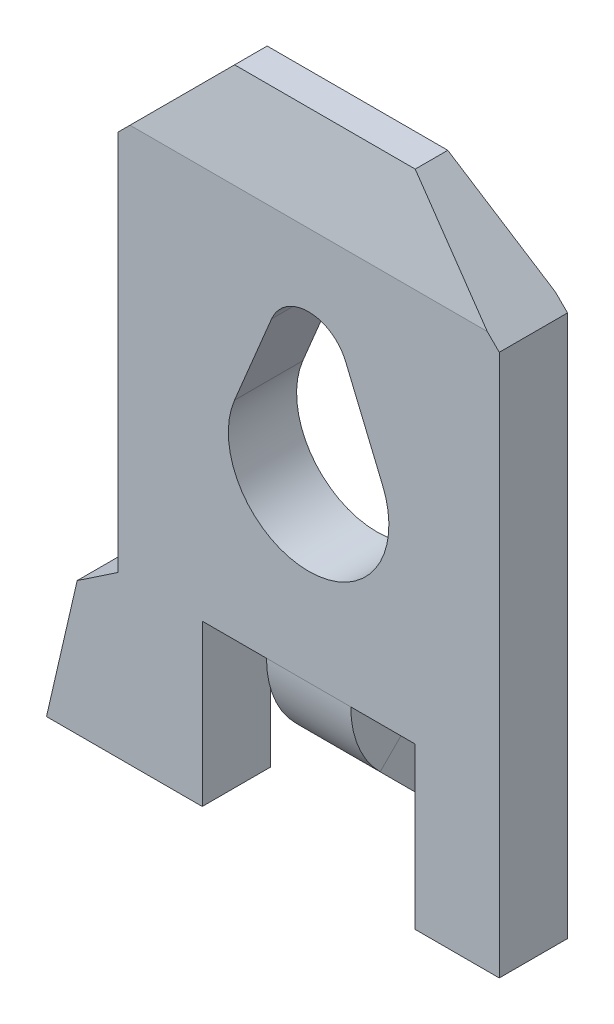
ISO-10303-21;
HEADER;
FILE_DESCRIPTION(('STEP AP214'),'2;1');
FILE_NAME('part.step','',(''),(''),'','','');
FILE_SCHEMA(('AUTOMOTIVE_DESIGN { 1 0 10303 214 1 1 1 1 }'));
ENDSEC;
DATA;
#1=APPLICATION_CONTEXT('core data for automotive mechanical design processes');
#2=APPLICATION_PROTOCOL_DEFINITION('international standard','automotive_design',2000,#1);
#3=PRODUCT_CONTEXT('',#1,'mechanical');
#4=PRODUCT('Part','Part','',(#3));
#5=PRODUCT_RELATED_PRODUCT_CATEGORY('part','',(#4));
#6=PRODUCT_DEFINITION_FORMATION('','',#4);
#7=PRODUCT_DEFINITION_CONTEXT('part definition',#1,'design');
#8=PRODUCT_DEFINITION('design','',#6,#7);
#9=PRODUCT_DEFINITION_SHAPE('','',#8);
#10=(LENGTH_UNIT() NAMED_UNIT(*) SI_UNIT(.MILLI.,.METRE.));
#11=(NAMED_UNIT(*) PLANE_ANGLE_UNIT() SI_UNIT($,.RADIAN.));
#12=(NAMED_UNIT(*) SI_UNIT($,.STERADIAN.) SOLID_ANGLE_UNIT());
#13=UNCERTAINTY_MEASURE_WITH_UNIT(LENGTH_MEASURE(1.E-05),#10,'distance_accuracy_value','');
#14=(GEOMETRIC_REPRESENTATION_CONTEXT(3) GLOBAL_UNCERTAINTY_ASSIGNED_CONTEXT((#13)) GLOBAL_UNIT_ASSIGNED_CONTEXT((#10,
#11,#12)) REPRESENTATION_CONTEXT('',''));
#15=CARTESIAN_POINT('',(0.,0.,0.));
#16=DIRECTION('',(0.,0.,1.));
#17=DIRECTION('',(1.,0.,0.));
#18=AXIS2_PLACEMENT_3D('',#15,#16,#17);
#19=CARTESIAN_POINT('',(4.75,0.149999999999999,0.));
#20=DIRECTION('',(0.,0.,1.));
#21=DIRECTION('',(0.,-1.,0.));
#22=AXIS2_PLACEMENT_3D('',#19,#20,#21);
#23=PLANE('',#22);
#24=DIRECTION('',(0.384813689288075,-0.922994271128755,0.));
#25=VECTOR('',#24,1.);
#26=CARTESIAN_POINT('',(2.84243697464802,5.82748992853653,0.));
#27=LINE('',#26,#25);
#28=CARTESIAN_POINT('',(2.84243697464802,5.82748992853653,0.));
#29=VERTEX_POINT('',#28);
#30=CARTESIAN_POINT('',(3.29799427112875,4.73481368928808,0.));
#31=VERTEX_POINT('',#30);
#32=EDGE_CURVE('E312',#29,#31,#27,.T.);
#33=ORIENTED_EDGE('',*,*,#32,.F.);
#34=CARTESIAN_POINT('',(2.375,5.65,0.));
#35=DIRECTION('',(0.,0.,1.));
#36=DIRECTION('',(0.,-1.,0.));
#37=AXIS2_PLACEMENT_3D('',#34,#35,#36);
#38=CIRCLE('',#37,0.5);
#39=CARTESIAN_POINT('',(1.91346153846154,5.84230769230769,0.));
#40=VERTEX_POINT('',#39);
#41=EDGE_CURVE('E315',#40,#29,#38,.F.);
#42=ORIENTED_EDGE('',*,*,#41,.F.);
#43=DIRECTION('',(0.384615384615385,0.923076923076923,0.));
#44=VECTOR('',#43,1.);
#45=CARTESIAN_POINT('',(1.91346153846154,5.84230769230769,0.));
#46=LINE('',#45,#44);
#47=CARTESIAN_POINT('',(1.45192307692308,4.73461538461538,0.));
#48=VERTEX_POINT('',#47);
#49=EDGE_CURVE('E317',#48,#40,#46,.T.);
#50=ORIENTED_EDGE('',*,*,#49,.F.);
#51=CARTESIAN_POINT('',(2.375,4.35,0.));
#52=DIRECTION('',(0.,0.,1.));
#53=DIRECTION('',(0.,-1.,0.));
#54=AXIS2_PLACEMENT_3D('',#51,#52,#53);
#55=CIRCLE('',#54,0.999999999999999);
#56=EDGE_CURVE('E309',#31,#48,#55,.F.);
#57=ORIENTED_EDGE('',*,*,#56,.F.);
#58=EDGE_LOOP('',(#33,#42,#50,#57));
#59=FACE_BOUND('',#58,.T.);
#60=DIRECTION('',(1.,0.,0.));
#61=VECTOR('',#60,1.);
#62=CARTESIAN_POINT('',(2.9,2.15,0.));
#63=LINE('',#62,#61);
#64=CARTESIAN_POINT('',(2.9,2.15,0.));
#65=VERTEX_POINT('',#64);
#66=CARTESIAN_POINT('',(3.7,2.15,0.));
#67=VERTEX_POINT('',#66);
#68=EDGE_CURVE('E276',#65,#67,#63,.T.);
#69=ORIENTED_EDGE('',*,*,#68,.F.);
#70=DIRECTION('',(-1.,0.,0.));
#71=VECTOR('',#70,1.);
#72=CARTESIAN_POINT('',(4.75,2.15,0.));
#73=LINE('',#72,#71);
#74=CARTESIAN_POINT('',(1.85,2.15,0.));
#75=VERTEX_POINT('',#74);
#76=EDGE_CURVE('E51',#65,#75,#73,.T.);
#77=ORIENTED_EDGE('',*,*,#76,.T.);
#78=DIRECTION('',(1.,0.,0.));
#79=VECTOR('',#78,1.);
#80=CARTESIAN_POINT('',(1.85,2.15,0.));
#81=LINE('',#80,#79);
#82=CARTESIAN_POINT('',(1.05,2.15,0.));
#83=VERTEX_POINT('',#82);
#84=EDGE_CURVE('E287',#83,#75,#81,.T.);
#85=ORIENTED_EDGE('',*,*,#84,.F.);
#86=DIRECTION('',(0.,1.,0.));
#87=VECTOR('',#86,1.);
#88=CARTESIAN_POINT('',(1.05,2.15,0.));
#89=LINE('',#88,#87);
#90=CARTESIAN_POINT('',(1.05,0.149999999999999,0.));
#91=VERTEX_POINT('',#90);
#92=EDGE_CURVE('E284',#91,#83,#89,.T.);
#93=ORIENTED_EDGE('',*,*,#92,.F.);
#94=DIRECTION('',(-1.,0.,0.));
#95=VECTOR('',#94,1.);
#96=CARTESIAN_POINT('',(4.75,0.149999999999999,0.));
#97=LINE('',#96,#95);
#98=CARTESIAN_POINT('',(-0.890356386047537,0.149999999999998,0.));
#99=VERTEX_POINT('',#98);
#100=EDGE_CURVE('E381',#91,#99,#97,.T.);
#101=ORIENTED_EDGE('',*,*,#100,.T.);
#102=DIRECTION('',(0.224692209858573,0.974429787531596,0.));
#103=VECTOR('',#102,1.);
#104=CARTESIAN_POINT('',(-0.507898340442458,1.80861785930754,0.));
#105=LINE('',#104,#103);
#106=CARTESIAN_POINT('',(-0.507898340442458,1.80861785930754,0.));
#107=VERTEX_POINT('',#106);
#108=EDGE_CURVE('E230',#99,#107,#105,.T.);
#109=ORIENTED_EDGE('',*,*,#108,.T.);
#110=DIRECTION('',(0.829945240760083,0.557844868525011,0.));
#111=VECTOR('',#110,1.);
#112=CARTESIAN_POINT('',(0.,2.15,0.));
#113=LINE('',#112,#111);
#114=CARTESIAN_POINT('',(0.,2.15,0.));
#115=VERTEX_POINT('',#114);
#116=EDGE_CURVE('E208',#107,#115,#113,.T.);
#117=ORIENTED_EDGE('',*,*,#116,.T.);
#118=DIRECTION('',(0.,1.,0.));
#119=VECTOR('',#118,1.);
#120=CARTESIAN_POINT('',(0.,0.149999999999999,0.));
#121=LINE('',#120,#119);
#122=CARTESIAN_POINT('',(0.,6.9,0.));
#123=VERTEX_POINT('',#122);
#124=EDGE_CURVE('E371',#115,#123,#121,.T.);
#125=ORIENTED_EDGE('',*,*,#124,.T.);
#126=DIRECTION('',(-0.707106781186548,-0.707106781186548,0.));
#127=VECTOR('',#126,1.);
#128=CARTESIAN_POINT('',(0.,6.9,0.));
#129=LINE('',#128,#127);
#130=CARTESIAN_POINT('',(0.15,7.05,0.));
#131=VERTEX_POINT('',#130);
#132=EDGE_CURVE('E345',#131,#123,#129,.T.);
#133=ORIENTED_EDGE('',*,*,#132,.F.);
#134=DIRECTION('',(-1.,0.,0.));
#135=VECTOR('',#134,1.);
#136=CARTESIAN_POINT('',(4.75,7.05,0.));
#137=LINE('',#136,#135);
#138=CARTESIAN_POINT('',(4.6,7.05,0.));
#139=VERTEX_POINT('',#138);
#140=EDGE_CURVE('E376',#139,#131,#137,.T.);
#141=ORIENTED_EDGE('',*,*,#140,.F.);
#142=DIRECTION('',(-0.707106781186548,0.707106781186548,0.));
#143=VECTOR('',#142,1.);
#144=CARTESIAN_POINT('',(3.5,8.15,0.));
#145=LINE('',#144,#143);
#146=CARTESIAN_POINT('',(4.75,6.9,0.));
#147=VERTEX_POINT('',#146);
#148=EDGE_CURVE('E341',#147,#139,#145,.T.);
#149=ORIENTED_EDGE('',*,*,#148,.F.);
#150=DIRECTION('',(0.,1.,0.));
#151=VECTOR('',#150,1.);
#152=CARTESIAN_POINT('',(4.75,0.149999999999999,0.));
#153=LINE('',#152,#151);
#154=CARTESIAN_POINT('',(4.75,0.149999999999999,0.));
#155=VERTEX_POINT('',#154);
#156=EDGE_CURVE('E373',#155,#147,#153,.T.);
#157=ORIENTED_EDGE('',*,*,#156,.F.);
#158=CARTESIAN_POINT('',(3.7,0.149999999999999,0.));
#159=VERTEX_POINT('',#158);
#160=EDGE_CURVE('E382',#155,#159,#97,.T.);
#161=ORIENTED_EDGE('',*,*,#160,.T.);
#162=DIRECTION('',(0.,-1.,0.));
#163=VECTOR('',#162,1.);
#164=CARTESIAN_POINT('',(3.7,2.15,0.));
#165=LINE('',#164,#163);
#166=EDGE_CURVE('E301',#67,#159,#165,.T.);
#167=ORIENTED_EDGE('',*,*,#166,.F.);
#168=EDGE_LOOP('',(#69,#77,#85,#93,#101,#109,#117,#125,#133,#141,#149,#157,#161,#167));
#169=FACE_BOUND('',#168,.T.);
#170=ADVANCED_FACE('F44',(#59,#169),#23,.F.);
#171=CARTESIAN_POINT('',(4.75,7.05,0.85));
#172=DIRECTION('',(0.,0.,-1.));
#173=DIRECTION('',(0.,1.,0.));
#174=AXIS2_PLACEMENT_3D('',#171,#172,#173);
#175=PLANE('',#174);
#176=DIRECTION('',(-0.384615384615385,-0.923076923076923,0.));
#177=VECTOR('',#176,1.);
#178=CARTESIAN_POINT('',(1.91346153846154,5.84230769230769,0.849999999999999));
#179=LINE('',#178,#177);
#180=CARTESIAN_POINT('',(1.91346153846154,5.84230769230769,0.85));
#181=VERTEX_POINT('',#180);
#182=CARTESIAN_POINT('',(1.45192307692308,4.73461538461538,0.849999999999999));
#183=VERTEX_POINT('',#182);
#184=EDGE_CURVE('E319',#181,#183,#179,.T.);
#185=ORIENTED_EDGE('',*,*,#184,.F.);
#186=CARTESIAN_POINT('',(2.375,5.65,0.849999999999999));
#187=DIRECTION('',(0.,0.,1.));
#188=DIRECTION('',(1.,0.,0.));
#189=AXIS2_PLACEMENT_3D('',#186,#187,#188);
#190=CIRCLE('',#189,0.5);
#191=CARTESIAN_POINT('',(2.84243697464802,5.82748992853653,0.849999999999999));
#192=VERTEX_POINT('',#191);
#193=EDGE_CURVE('E295',#192,#181,#190,.T.);
#194=ORIENTED_EDGE('',*,*,#193,.F.);
#195=DIRECTION('',(-0.384813689288075,0.922994271128755,0.));
#196=VECTOR('',#195,1.);
#197=CARTESIAN_POINT('',(2.84243697464802,5.82748992853653,0.849999999999999));
#198=LINE('',#197,#196);
#199=CARTESIAN_POINT('',(3.29799427112875,4.73481368928808,0.849999999999999));
#200=VERTEX_POINT('',#199);
#201=EDGE_CURVE('E325',#200,#192,#198,.T.);
#202=ORIENTED_EDGE('',*,*,#201,.F.);
#203=CARTESIAN_POINT('',(2.375,4.35,0.849999999999999));
#204=DIRECTION('',(0.,0.,1.));
#205=DIRECTION('',(1.,0.,0.));
#206=AXIS2_PLACEMENT_3D('',#203,#204,#205);
#207=CIRCLE('',#206,0.999999999999999);
#208=EDGE_CURVE('E322',#183,#200,#207,.T.);
#209=ORIENTED_EDGE('',*,*,#208,.F.);
#210=EDGE_LOOP('',(#185,#194,#202,#209));
#211=FACE_BOUND('',#210,.T.);
#212=DIRECTION('',(-1.,0.,0.));
#213=VECTOR('',#212,1.);
#214=CARTESIAN_POINT('',(1.85,2.15,0.85));
#215=LINE('',#214,#213);
#216=CARTESIAN_POINT('',(1.85,2.15,0.85));
#217=VERTEX_POINT('',#216);
#218=CARTESIAN_POINT('',(1.05,2.15,0.85));
#219=VERTEX_POINT('',#218);
#220=EDGE_CURVE('E280',#217,#219,#215,.T.);
#221=ORIENTED_EDGE('',*,*,#220,.F.);
#222=DIRECTION('',(1.,0.,0.));
#223=VECTOR('',#222,1.);
#224=CARTESIAN_POINT('',(4.75,2.15,0.849999999999999));
#225=LINE('',#224,#223);
#226=CARTESIAN_POINT('',(2.9,2.15,0.849999999999999));
#227=VERTEX_POINT('',#226);
#228=EDGE_CURVE('E398',#217,#227,#225,.T.);
#229=ORIENTED_EDGE('',*,*,#228,.T.);
#230=DIRECTION('',(-1.,0.,0.));
#231=VECTOR('',#230,1.);
#232=CARTESIAN_POINT('',(2.9,2.15,0.85));
#233=LINE('',#232,#231);
#234=CARTESIAN_POINT('',(3.7,2.15,0.85));
#235=VERTEX_POINT('',#234);
#236=EDGE_CURVE('E288',#235,#227,#233,.T.);
#237=ORIENTED_EDGE('',*,*,#236,.F.);
#238=DIRECTION('',(0.,1.,0.));
#239=VECTOR('',#238,1.);
#240=CARTESIAN_POINT('',(3.7,2.15,0.85));
#241=LINE('',#240,#239);
#242=CARTESIAN_POINT('',(3.7,0.149999999999999,0.849999999999999));
#243=VERTEX_POINT('',#242);
#244=EDGE_CURVE('E296',#243,#235,#241,.T.);
#245=ORIENTED_EDGE('',*,*,#244,.F.);
#246=DIRECTION('',(-1.,0.,0.));
#247=VECTOR('',#246,1.);
#248=CARTESIAN_POINT('',(4.75,0.149999999999999,0.849999999999999));
#249=LINE('',#248,#247);
#250=CARTESIAN_POINT('',(4.75,0.149999999999999,0.849999999999999));
#251=VERTEX_POINT('',#250);
#252=EDGE_CURVE('E386',#251,#243,#249,.T.);
#253=ORIENTED_EDGE('',*,*,#252,.F.);
#254=DIRECTION('',(0.,-1.,0.));
#255=VECTOR('',#254,1.);
#256=CARTESIAN_POINT('',(4.75,7.05,0.85));
#257=LINE('',#256,#255);
#258=CARTESIAN_POINT('',(4.75,6.9,0.85));
#259=VERTEX_POINT('',#258);
#260=EDGE_CURVE('E368',#259,#251,#257,.T.);
#261=ORIENTED_EDGE('',*,*,#260,.F.);
#262=DIRECTION('',(0.707106781186548,-0.707106781186548,0.));
#263=VECTOR('',#262,1.);
#264=CARTESIAN_POINT('',(3.5,8.15,0.849999999999999));
#265=LINE('',#264,#263);
#266=CARTESIAN_POINT('',(4.6,7.05,0.849999999999999));
#267=VERTEX_POINT('',#266);
#268=EDGE_CURVE('E337',#267,#259,#265,.T.);
#269=ORIENTED_EDGE('',*,*,#268,.F.);
#270=DIRECTION('',(-1.,0.,0.));
#271=VECTOR('',#270,1.);
#272=CARTESIAN_POINT('',(4.75,7.05,0.85));
#273=LINE('',#272,#271);
#274=CARTESIAN_POINT('',(0.15,7.05,0.849999999999999));
#275=VERTEX_POINT('',#274);
#276=EDGE_CURVE('E389',#267,#275,#273,.T.);
#277=ORIENTED_EDGE('',*,*,#276,.T.);
#278=DIRECTION('',(0.707106781186547,0.707106781186548,0.));
#279=VECTOR('',#278,1.);
#280=CARTESIAN_POINT('',(0.,6.9,0.849999999999999));
#281=LINE('',#280,#279);
#282=CARTESIAN_POINT('',(0.,6.9,0.849999999999999));
#283=VERTEX_POINT('',#282);
#284=EDGE_CURVE('E338',#283,#275,#281,.T.);
#285=ORIENTED_EDGE('',*,*,#284,.F.);
#286=DIRECTION('',(0.,-1.,0.));
#287=VECTOR('',#286,1.);
#288=CARTESIAN_POINT('',(0.,7.05,0.85));
#289=LINE('',#288,#287);
#290=CARTESIAN_POINT('',(0.,2.15,0.849999999999999));
#291=VERTEX_POINT('',#290);
#292=EDGE_CURVE('E227',#283,#291,#289,.T.);
#293=ORIENTED_EDGE('',*,*,#292,.T.);
#294=DIRECTION('',(-0.829945240760083,-0.557844868525011,0.));
#295=VECTOR('',#294,1.);
#296=CARTESIAN_POINT('',(0.,2.15,0.849999999999999));
#297=LINE('',#296,#295);
#298=CARTESIAN_POINT('',(-0.507898340442458,1.80861785930754,0.849999999999999));
#299=VERTEX_POINT('',#298);
#300=EDGE_CURVE('E58',#291,#299,#297,.T.);
#301=ORIENTED_EDGE('',*,*,#300,.T.);
#302=DIRECTION('',(-0.224692209858573,-0.974429787531596,0.));
#303=VECTOR('',#302,1.);
#304=CARTESIAN_POINT('',(-0.507898340442458,1.80861785930754,0.849999999999999));
#305=LINE('',#304,#303);
#306=CARTESIAN_POINT('',(-0.890356386047537,0.149999999999998,0.849999999999999));
#307=VERTEX_POINT('',#306);
#308=EDGE_CURVE('E216',#299,#307,#305,.T.);
#309=ORIENTED_EDGE('',*,*,#308,.T.);
#310=CARTESIAN_POINT('',(1.05,0.149999999999999,0.849999999999999));
#311=VERTEX_POINT('',#310);
#312=EDGE_CURVE('E385',#311,#307,#249,.T.);
#313=ORIENTED_EDGE('',*,*,#312,.F.);
#314=DIRECTION('',(0.,-1.,0.));
#315=VECTOR('',#314,1.);
#316=CARTESIAN_POINT('',(1.05,2.15,0.85));
#317=LINE('',#316,#315);
#318=EDGE_CURVE('E282',#219,#311,#317,.T.);
#319=ORIENTED_EDGE('',*,*,#318,.F.);
#320=EDGE_LOOP('',(#221,#229,#237,#245,#253,#261,#269,#277,#285,#293,#301,#309,#313,#319));
#321=FACE_BOUND('',#320,.T.);
#322=ADVANCED_FACE('F224',(#211,#321),#175,.F.);
#323=CARTESIAN_POINT('',(4.75,0.149999999999999,0.));
#324=DIRECTION('',(0.,1.,0.));
#325=DIRECTION('',(0.,0.,1.));
#326=AXIS2_PLACEMENT_3D('',#323,#324,#325);
#327=PLANE('',#326);
#328=ORIENTED_EDGE('',*,*,#100,.F.);
#329=DIRECTION('',(0.,0.,-1.));
#330=VECTOR('',#329,1.);
#331=CARTESIAN_POINT('',(1.05,0.149999999999999,3.0040659228538));
#332=LINE('',#331,#330);
#333=EDGE_CURVE('E291',#311,#91,#332,.T.);
#334=ORIENTED_EDGE('',*,*,#333,.F.);
#335=ORIENTED_EDGE('',*,*,#312,.T.);
#336=DIRECTION('',(0.,0.,1.));
#337=VECTOR('',#336,1.);
#338=CARTESIAN_POINT('',(-0.890356386047537,0.149999999999998,-2.18923148483107));
#339=LINE('',#338,#337);
#340=EDGE_CURVE('E211',#99,#307,#339,.T.);
#341=ORIENTED_EDGE('',*,*,#340,.F.);
#342=EDGE_LOOP('',(#328,#334,#335,#341));
#343=FACE_BOUND('',#342,.T.);
#344=ADVANCED_FACE('F456',(#343),#327,.F.);
#345=CARTESIAN_POINT('',(4.75,7.05,0.));
#346=DIRECTION('',(0.,-0.214348018272916,0.976757353216485));
#347=DIRECTION('',(0.,-0.976757353216485,-0.214348018272916));
#348=AXIS2_PLACEMENT_3D('',#345,#346,#347);
#349=PLANE('',#348);
#350=ORIENTED_EDGE('',*,*,#140,.T.);
#351=DIRECTION('',(0.698744344369524,0.698744344369524,0.153338457091523));
#352=VECTOR('',#351,1.);
#353=CARTESIAN_POINT('',(2.39592083042662,9.29592083042662,0.492864146468432));
#354=LINE('',#353,#352);
#355=CARTESIAN_POINT('',(1.25,8.15,0.241393442622949));
#356=VERTEX_POINT('',#355);
#357=EDGE_CURVE('E359',#131,#356,#354,.T.);
#358=ORIENTED_EDGE('',*,*,#357,.T.);
#359=DIRECTION('',(-1.,0.,0.));
#360=VECTOR('',#359,1.);
#361=CARTESIAN_POINT('',(4.75,8.15,0.241393442622949));
#362=LINE('',#361,#360);
#363=CARTESIAN_POINT('',(3.5,8.15,0.241393442622949));
#364=VERTEX_POINT('',#363);
#365=EDGE_CURVE('E395',#364,#356,#362,.T.);
#366=ORIENTED_EDGE('',*,*,#365,.F.);
#367=DIRECTION('',(0.698744344369524,-0.698744344369524,-0.153338457091523));
#368=VECTOR('',#367,1.);
#369=CARTESIAN_POINT('',(4.67323654881826,6.97676345118174,-0.0160716569500576));
#370=LINE('',#369,#368);
#371=EDGE_CURVE('E365',#364,#139,#370,.T.);
#372=ORIENTED_EDGE('',*,*,#371,.T.);
#373=EDGE_LOOP('',(#350,#358,#366,#372));
#374=FACE_BOUND('',#373,.T.);
#375=ADVANCED_FACE('F518',(#374),#349,.F.);
#376=CARTESIAN_POINT('',(4.75,8.15,0.241393442622949));
#377=DIRECTION('',(0.,-1.,0.));
#378=DIRECTION('',(0.,0.,-1.));
#379=AXIS2_PLACEMENT_3D('',#376,#377,#378);
#380=PLANE('',#379);
#381=ORIENTED_EDGE('',*,*,#365,.T.);
#382=DIRECTION('',(0.,0.,1.));
#383=VECTOR('',#382,1.);
#384=CARTESIAN_POINT('',(1.25,8.15,-1.76776695296637));
#385=LINE('',#384,#383);
#386=CARTESIAN_POINT('',(1.25,8.15,0.647131147540979));
#387=VERTEX_POINT('',#386);
#388=EDGE_CURVE('E342',#356,#387,#385,.T.);
#389=ORIENTED_EDGE('',*,*,#388,.T.);
#390=DIRECTION('',(-1.,0.,0.));
#391=VECTOR('',#390,1.);
#392=CARTESIAN_POINT('',(4.75,8.15,0.647131147540979));
#393=LINE('',#392,#391);
#394=CARTESIAN_POINT('',(3.5,8.15,0.647131147540979));
#395=VERTEX_POINT('',#394);
#396=EDGE_CURVE('E392',#395,#387,#393,.T.);
#397=ORIENTED_EDGE('',*,*,#396,.F.);
#398=DIRECTION('',(0.,0.,1.));
#399=VECTOR('',#398,1.);
#400=CARTESIAN_POINT('',(3.5,8.15,-1.76776695296637));
#401=LINE('',#400,#399);
#402=EDGE_CURVE('E351',#364,#395,#401,.T.);
#403=ORIENTED_EDGE('',*,*,#402,.F.);
#404=EDGE_LOOP('',(#381,#389,#397,#403));
#405=FACE_BOUND('',#404,.T.);
#406=ADVANCED_FACE('F514',(#405),#380,.F.);
#407=CARTESIAN_POINT('',(4.75,8.15,0.647131147540979));
#408=DIRECTION('',(0.,-0.181367589437408,-0.983415373838371));
#409=DIRECTION('',(0.,0.983415373838371,-0.181367589437408));
#410=AXIS2_PLACEMENT_3D('',#407,#408,#409);
#411=PLANE('',#410);
#412=ORIENTED_EDGE('',*,*,#396,.T.);
#413=DIRECTION('',(-0.70116968993079,-0.70116968993079,0.12931408215937));
#414=VECTOR('',#413,1.);
#415=CARTESIAN_POINT('',(2.97073626927174,9.87073626927174,0.329782245421185));
#416=LINE('',#415,#414);
#417=EDGE_CURVE('E349',#387,#275,#416,.T.);
#418=ORIENTED_EDGE('',*,*,#417,.T.);
#419=ORIENTED_EDGE('',*,*,#276,.F.);
#420=DIRECTION('',(-0.70116968993079,0.70116968993079,-0.12931408215937));
#421=VECTOR('',#420,1.);
#422=CARTESIAN_POINT('',(4.11454866759705,7.53545133240295,0.760470041155192));
#423=LINE('',#422,#421);
#424=EDGE_CURVE('E362',#267,#395,#423,.T.);
#425=ORIENTED_EDGE('',*,*,#424,.T.);
#426=EDGE_LOOP('',(#412,#418,#419,#425));
#427=FACE_BOUND('',#426,.T.);
#428=ADVANCED_FACE('F510',(#427),#411,.F.);
#429=ORIENTED_EDGE('',*,*,#252,.T.);
#430=DIRECTION('',(0.,0.,-1.));
#431=VECTOR('',#430,1.);
#432=CARTESIAN_POINT('',(3.7,0.149999999999999,3.0040659228538));
#433=LINE('',#432,#431);
#434=EDGE_CURVE('E298',#243,#159,#433,.T.);
#435=ORIENTED_EDGE('',*,*,#434,.T.);
#436=ORIENTED_EDGE('',*,*,#160,.F.);
#437=DIRECTION('',(0.,0.,-1.));
#438=VECTOR('',#437,1.);
#439=CARTESIAN_POINT('',(4.75,0.149999999999999,0.));
#440=LINE('',#439,#438);
#441=EDGE_CURVE('E370',#251,#155,#440,.T.);
#442=ORIENTED_EDGE('',*,*,#441,.F.);
#443=EDGE_LOOP('',(#429,#435,#436,#442));
#444=FACE_BOUND('',#443,.T.);
#445=ADVANCED_FACE('F503',(#444),#327,.F.);
#446=CARTESIAN_POINT('',(4.75,0.,0.));
#447=DIRECTION('',(1.,0.,0.));
#448=DIRECTION('',(0.,0.,-1.));
#449=AXIS2_PLACEMENT_3D('',#446,#447,#448);
#450=PLANE('',#449);
#451=DIRECTION('',(0.,0.,1.));
#452=VECTOR('',#451,1.);
#453=CARTESIAN_POINT('',(4.75,6.9,-1.76776695296637));
#454=LINE('',#453,#452);
#455=EDGE_CURVE('E352',#147,#259,#454,.T.);
#456=ORIENTED_EDGE('',*,*,#455,.T.);
#457=ORIENTED_EDGE('',*,*,#260,.T.);
#458=ORIENTED_EDGE('',*,*,#441,.T.);
#459=ORIENTED_EDGE('',*,*,#156,.T.);
#460=EDGE_LOOP('',(#456,#457,#458,#459));
#461=FACE_BOUND('',#460,.T.);
#462=ADVANCED_FACE('F500',(#461),#450,.T.);
#463=CARTESIAN_POINT('',(0.,0.,0.));
#464=DIRECTION('',(1.,0.,0.));
#465=DIRECTION('',(0.,0.,-1.));
#466=AXIS2_PLACEMENT_3D('',#463,#464,#465);
#467=PLANE('',#466);
#468=ORIENTED_EDGE('',*,*,#124,.F.);
#469=DIRECTION('',(0.,0.,1.));
#470=VECTOR('',#469,1.);
#471=CARTESIAN_POINT('',(0.,2.15,-2.18923148483107));
#472=LINE('',#471,#470);
#473=EDGE_CURVE('E212',#115,#291,#472,.T.);
#474=ORIENTED_EDGE('',*,*,#473,.T.);
#475=ORIENTED_EDGE('',*,*,#292,.F.);
#476=DIRECTION('',(0.,0.,1.));
#477=VECTOR('',#476,1.);
#478=CARTESIAN_POINT('',(0.,6.9,-1.76776695296637));
#479=LINE('',#478,#477);
#480=EDGE_CURVE('E340',#123,#283,#479,.T.);
#481=ORIENTED_EDGE('',*,*,#480,.F.);
#482=EDGE_LOOP('',(#468,#474,#475,#481));
#483=FACE_BOUND('',#482,.T.);
#484=ADVANCED_FACE('F495',(#483),#467,.F.);
#485=CARTESIAN_POINT('',(0.,6.9,-1.76776695296637));
#486=DIRECTION('',(0.707106781186548,-0.707106781186548,0.));
#487=DIRECTION('',(0.707106781186548,0.707106781186548,0.));
#488=AXIS2_PLACEMENT_3D('',#485,#486,#487);
#489=PLANE('',#488);
#490=ORIENTED_EDGE('',*,*,#132,.T.);
#491=ORIENTED_EDGE('',*,*,#480,.T.);
#492=ORIENTED_EDGE('',*,*,#284,.T.);
#493=ORIENTED_EDGE('',*,*,#417,.F.);
#494=ORIENTED_EDGE('',*,*,#388,.F.);
#495=ORIENTED_EDGE('',*,*,#357,.F.);
#496=EDGE_LOOP('',(#490,#491,#492,#493,#494,#495));
#497=FACE_BOUND('',#496,.T.);
#498=ADVANCED_FACE('F492',(#497),#489,.F.);
#499=CARTESIAN_POINT('',(3.5,8.15,-1.76776695296637));
#500=DIRECTION('',(-0.707106781186547,-0.707106781186547,0.));
#501=DIRECTION('',(0.707106781186548,-0.707106781186548,0.));
#502=AXIS2_PLACEMENT_3D('',#499,#500,#501);
#503=PLANE('',#502);
#504=ORIENTED_EDGE('',*,*,#402,.T.);
#505=ORIENTED_EDGE('',*,*,#424,.F.);
#506=ORIENTED_EDGE('',*,*,#268,.T.);
#507=ORIENTED_EDGE('',*,*,#455,.F.);
#508=ORIENTED_EDGE('',*,*,#148,.T.);
#509=ORIENTED_EDGE('',*,*,#371,.F.);
#510=EDGE_LOOP('',(#504,#505,#506,#507,#508,#509));
#511=FACE_BOUND('',#510,.T.);
#512=ADVANCED_FACE('F491',(#511),#503,.F.);
#513=CARTESIAN_POINT('',(2.375,5.65,-3.44093010681705));
#514=DIRECTION('',(0.,0.,1.));
#515=DIRECTION('',(1.,0.,0.));
#516=AXIS2_PLACEMENT_3D('',#513,#514,#515);
#517=CYLINDRICAL_SURFACE('',#516,0.5);
#518=ORIENTED_EDGE('',*,*,#41,.T.);
#519=DIRECTION('',(0.,0.,1.));
#520=VECTOR('',#519,1.);
#521=CARTESIAN_POINT('',(2.84243697464802,5.82748992853653,-3.44093010681705));
#522=LINE('',#521,#520);
#523=EDGE_CURVE('E313',#29,#192,#522,.T.);
#524=ORIENTED_EDGE('',*,*,#523,.T.);
#525=ORIENTED_EDGE('',*,*,#193,.T.);
#526=DIRECTION('',(0.,0.,1.));
#527=VECTOR('',#526,1.);
#528=CARTESIAN_POINT('',(1.91346153846154,5.84230769230769,-3.44093010681705));
#529=LINE('',#528,#527);
#530=EDGE_CURVE('E328',#40,#181,#529,.T.);
#531=ORIENTED_EDGE('',*,*,#530,.F.);
#532=EDGE_LOOP('',(#518,#524,#525,#531));
#533=FACE_BOUND('',#532,.T.);
#534=ADVANCED_FACE('F474',(#533),#517,.F.);
#535=CARTESIAN_POINT('',(2.84243697464802,5.82748992853653,-3.44093010681705));
#536=DIRECTION('',(0.922994271128755,0.384813689288075,0.));
#537=DIRECTION('',(-0.384813689288075,0.922994271128755,0.));
#538=AXIS2_PLACEMENT_3D('',#535,#536,#537);
#539=PLANE('',#538);
#540=ORIENTED_EDGE('',*,*,#32,.T.);
#541=DIRECTION('',(0.,0.,1.));
#542=VECTOR('',#541,1.);
#543=CARTESIAN_POINT('',(3.29799427112875,4.73481368928808,-3.44093010681705));
#544=LINE('',#543,#542);
#545=EDGE_CURVE('E330',#31,#200,#544,.T.);
#546=ORIENTED_EDGE('',*,*,#545,.T.);
#547=ORIENTED_EDGE('',*,*,#201,.T.);
#548=ORIENTED_EDGE('',*,*,#523,.F.);
#549=EDGE_LOOP('',(#540,#546,#547,#548));
#550=FACE_BOUND('',#549,.T.);
#551=ADVANCED_FACE('F465',(#550),#539,.F.);
#552=CARTESIAN_POINT('',(2.375,4.35,-3.44093010681705));
#553=DIRECTION('',(0.,0.,1.));
#554=DIRECTION('',(1.,0.,0.));
#555=AXIS2_PLACEMENT_3D('',#552,#553,#554);
#556=CYLINDRICAL_SURFACE('',#555,0.999999999999999);
#557=ORIENTED_EDGE('',*,*,#56,.T.);
#558=DIRECTION('',(0.,0.,1.));
#559=VECTOR('',#558,1.);
#560=CARTESIAN_POINT('',(1.45192307692308,4.73461538461538,-3.44093010681705));
#561=LINE('',#560,#559);
#562=EDGE_CURVE('E332',#48,#183,#561,.T.);
#563=ORIENTED_EDGE('',*,*,#562,.T.);
#564=ORIENTED_EDGE('',*,*,#208,.T.);
#565=ORIENTED_EDGE('',*,*,#545,.F.);
#566=EDGE_LOOP('',(#557,#563,#564,#565));
#567=FACE_BOUND('',#566,.T.);
#568=ADVANCED_FACE('F467',(#567),#556,.F.);
#569=CARTESIAN_POINT('',(1.91346153846154,5.84230769230769,-3.44093010681705));
#570=DIRECTION('',(-0.923076923076923,0.384615384615385,0.));
#571=DIRECTION('',(-0.384615384615385,-0.923076923076923,0.));
#572=AXIS2_PLACEMENT_3D('',#569,#570,#571);
#573=PLANE('',#572);
#574=ORIENTED_EDGE('',*,*,#49,.T.);
#575=ORIENTED_EDGE('',*,*,#530,.T.);
#576=ORIENTED_EDGE('',*,*,#184,.T.);
#577=ORIENTED_EDGE('',*,*,#562,.F.);
#578=EDGE_LOOP('',(#574,#575,#576,#577));
#579=FACE_BOUND('',#578,.T.);
#580=ADVANCED_FACE('F476',(#579),#573,.F.);
#581=CARTESIAN_POINT('',(3.7,2.15,3.0040659228538));
#582=DIRECTION('',(1.,0.,0.));
#583=DIRECTION('',(0.,1.,0.));
#584=AXIS2_PLACEMENT_3D('',#581,#582,#583);
#585=PLANE('',#584);
#586=ORIENTED_EDGE('',*,*,#244,.T.);
#587=DIRECTION('',(0.,0.,-1.));
#588=VECTOR('',#587,1.);
#589=CARTESIAN_POINT('',(3.7,2.15,3.0040659228538));
#590=LINE('',#589,#588);
#591=EDGE_CURVE('E303',#235,#67,#590,.T.);
#592=ORIENTED_EDGE('',*,*,#591,.T.);
#593=ORIENTED_EDGE('',*,*,#166,.T.);
#594=ORIENTED_EDGE('',*,*,#434,.F.);
#595=EDGE_LOOP('',(#586,#592,#593,#594));
#596=FACE_BOUND('',#595,.T.);
#597=ADVANCED_FACE('F478',(#596),#585,.F.);
#598=CARTESIAN_POINT('',(2.9,2.15,3.0040659228538));
#599=DIRECTION('',(0.,1.,0.));
#600=DIRECTION('',(-1.,0.,0.));
#601=AXIS2_PLACEMENT_3D('',#598,#599,#600);
#602=PLANE('',#601);
#603=ORIENTED_EDGE('',*,*,#236,.T.);
#604=DIRECTION('',(0.,0.,-1.));
#605=VECTOR('',#604,1.);
#606=CARTESIAN_POINT('',(2.9,2.15,3.0040659228538));
#607=LINE('',#606,#605);
#608=EDGE_CURVE('E12',#227,#65,#607,.T.);
#609=ORIENTED_EDGE('',*,*,#608,.T.);
#610=ORIENTED_EDGE('',*,*,#68,.T.);
#611=ORIENTED_EDGE('',*,*,#591,.F.);
#612=EDGE_LOOP('',(#603,#609,#610,#611));
#613=FACE_BOUND('',#612,.T.);
#614=ADVANCED_FACE('F409',(#613),#602,.F.);
#615=CARTESIAN_POINT('',(1.85,2.15,3.0040659228538));
#616=DIRECTION('',(0.,1.,0.));
#617=DIRECTION('',(0.,0.,1.));
#618=AXIS2_PLACEMENT_3D('',#615,#616,#617);
#619=PLANE('',#618);
#620=ORIENTED_EDGE('',*,*,#220,.T.);
#621=DIRECTION('',(0.,0.,-1.));
#622=VECTOR('',#621,1.);
#623=CARTESIAN_POINT('',(1.05,2.15,3.0040659228538));
#624=LINE('',#623,#622);
#625=EDGE_CURVE('E283',#219,#83,#624,.T.);
#626=ORIENTED_EDGE('',*,*,#625,.T.);
#627=ORIENTED_EDGE('',*,*,#84,.T.);
#628=DIRECTION('',(0.,0.,-1.));
#629=VECTOR('',#628,1.);
#630=CARTESIAN_POINT('',(1.85,2.15,3.0040659228538));
#631=LINE('',#630,#629);
#632=EDGE_CURVE('E401',#217,#75,#631,.T.);
#633=ORIENTED_EDGE('',*,*,#632,.F.);
#634=EDGE_LOOP('',(#620,#626,#627,#633));
#635=FACE_BOUND('',#634,.T.);
#636=ADVANCED_FACE('F422',(#635),#619,.F.);
#637=CARTESIAN_POINT('',(1.05,2.15,3.0040659228538));
#638=DIRECTION('',(-1.,0.,0.));
#639=DIRECTION('',(0.,-1.,0.));
#640=AXIS2_PLACEMENT_3D('',#637,#638,#639);
#641=PLANE('',#640);
#642=ORIENTED_EDGE('',*,*,#318,.T.);
#643=ORIENTED_EDGE('',*,*,#333,.T.);
#644=ORIENTED_EDGE('',*,*,#92,.T.);
#645=ORIENTED_EDGE('',*,*,#625,.F.);
#646=EDGE_LOOP('',(#642,#643,#644,#645));
#647=FACE_BOUND('',#646,.T.);
#648=ADVANCED_FACE('F544',(#647),#641,.F.);
#649=CARTESIAN_POINT('',(1.85,2.15,-0.400000000000001));
#650=DIRECTION('',(-1.,0.,0.));
#651=DIRECTION('',(0.,0.,1.));
#652=AXIS2_PLACEMENT_3D('',#649,#650,#651);
#653=PLANE('',#652);
#654=ORIENTED_EDGE('',*,*,#632,.T.);
#655=CARTESIAN_POINT('',(1.85,2.15,-0.400000000000001));
#656=DIRECTION('',(1.,0.,0.));
#657=DIRECTION('',(0.,1.,0.));
#658=AXIS2_PLACEMENT_3D('',#655,#656,#657);
#659=CIRCLE('',#658,0.4);
#660=CARTESIAN_POINT('',(1.85,1.86715728752538,-0.117157287525382));
#661=VERTEX_POINT('',#660);
#662=EDGE_CURVE('E238',#75,#661,#659,.T.);
#663=ORIENTED_EDGE('',*,*,#662,.T.);
#664=DIRECTION('',(0.,-0.707106781186554,0.707106781186541));
#665=VECTOR('',#664,1.);
#666=CARTESIAN_POINT('',(1.85,-0.257038097655978,2.00703809765595));
#667=LINE('',#666,#665);
#668=CARTESIAN_POINT('',(1.85,1.26611652351682,0.483883476483182));
#669=VERTEX_POINT('',#668);
#670=EDGE_CURVE('E258',#661,#669,#667,.T.);
#671=ORIENTED_EDGE('',*,*,#670,.T.);
#672=CARTESIAN_POINT('',(1.85,2.15,-0.400000000000001));
#673=DIRECTION('',(1.,0.,0.));
#674=DIRECTION('',(0.,0.,1.));
#675=AXIS2_PLACEMENT_3D('',#672,#673,#674);
#676=CIRCLE('',#675,1.25);
#677=EDGE_CURVE('E269',#217,#669,#676,.T.);
#678=ORIENTED_EDGE('',*,*,#677,.F.);
#679=EDGE_LOOP('',(#654,#663,#671,#678));
#680=FACE_BOUND('',#679,.T.);
#681=ADVANCED_FACE('F424',(#680),#653,.T.);
#682=CARTESIAN_POINT('',(2.9,2.15,-0.400000000000001));
#683=DIRECTION('',(1.,0.,0.));
#684=DIRECTION('',(0.,0.,-1.));
#685=AXIS2_PLACEMENT_3D('',#682,#683,#684);
#686=PLANE('',#685);
#687=DIRECTION('',(0.,0.707106781186554,-0.707106781186541));
#688=VECTOR('',#687,1.);
#689=CARTESIAN_POINT('',(2.9,-0.257038097655979,2.00703809765595));
#690=LINE('',#689,#688);
#691=CARTESIAN_POINT('',(2.9,1.26611652351682,0.483883476483185));
#692=VERTEX_POINT('',#691);
#693=CARTESIAN_POINT('',(2.9,1.86715728752538,-0.117157287525382));
#694=VERTEX_POINT('',#693);
#695=EDGE_CURVE('E264',#692,#694,#690,.T.);
#696=ORIENTED_EDGE('',*,*,#695,.T.);
#697=CARTESIAN_POINT('',(2.9,2.15,-0.400000000000001));
#698=DIRECTION('',(1.,0.,0.));
#699=DIRECTION('',(0.,1.,0.));
#700=AXIS2_PLACEMENT_3D('',#697,#698,#699);
#701=CIRCLE('',#700,0.4);
#702=EDGE_CURVE('E273',#694,#65,#701,.F.);
#703=ORIENTED_EDGE('',*,*,#702,.T.);
#704=ORIENTED_EDGE('',*,*,#608,.F.);
#705=CARTESIAN_POINT('',(2.9,2.15,-0.400000000000001));
#706=DIRECTION('',(-1.,0.,0.));
#707=DIRECTION('',(0.,0.,-1.));
#708=AXIS2_PLACEMENT_3D('',#705,#706,#707);
#709=CIRCLE('',#708,1.25);
#710=EDGE_CURVE('E272',#692,#227,#709,.T.);
#711=ORIENTED_EDGE('',*,*,#710,.F.);
#712=EDGE_LOOP('',(#696,#703,#704,#711));
#713=FACE_BOUND('',#712,.T.);
#714=ADVANCED_FACE('F413',(#713),#686,.T.);
#715=CARTESIAN_POINT('',(0.876719746353102,2.15,-0.400000000000001));
#716=DIRECTION('',(1.,0.,0.));
#717=DIRECTION('',(0.,1.,0.));
#718=AXIS2_PLACEMENT_3D('',#715,#716,#717);
#719=CYLINDRICAL_SURFACE('',#718,1.25);
#720=ORIENTED_EDGE('',*,*,#710,.T.);
#721=ORIENTED_EDGE('',*,*,#228,.F.);
#722=ORIENTED_EDGE('',*,*,#677,.T.);
#723=DIRECTION('',(1.,0.,0.));
#724=VECTOR('',#723,1.);
#725=CARTESIAN_POINT('',(4.75,1.26611652351681,0.48388347648318));
#726=LINE('',#725,#724);
#727=EDGE_CURVE('E235',#669,#692,#726,.T.);
#728=ORIENTED_EDGE('',*,*,#727,.T.);
#729=EDGE_LOOP('',(#720,#721,#722,#728));
#730=FACE_BOUND('',#729,.T.);
#731=ADVANCED_FACE('F416',(#730),#719,.T.);
#732=CARTESIAN_POINT('',(0.876719746353102,2.15,-0.400000000000001));
#733=DIRECTION('',(1.,0.,0.));
#734=DIRECTION('',(0.,1.,0.));
#735=AXIS2_PLACEMENT_3D('',#732,#733,#734);
#736=CYLINDRICAL_SURFACE('',#735,0.4);
#737=ORIENTED_EDGE('',*,*,#702,.F.);
#738=DIRECTION('',(-1.,0.,0.));
#739=VECTOR('',#738,1.);
#740=CARTESIAN_POINT('',(4.75,1.86715728752538,-0.11715728752538));
#741=LINE('',#740,#739);
#742=EDGE_CURVE('E261',#694,#661,#741,.T.);
#743=ORIENTED_EDGE('',*,*,#742,.T.);
#744=ORIENTED_EDGE('',*,*,#662,.F.);
#745=ORIENTED_EDGE('',*,*,#76,.F.);
#746=EDGE_LOOP('',(#737,#743,#744,#745));
#747=FACE_BOUND('',#746,.T.);
#748=ADVANCED_FACE('F425',(#747),#736,.F.);
#749=CARTESIAN_POINT('',(0.,0.204009246963323,-1.78030532808745));
#750=DIRECTION('',(0.,-0.707106781186546,-0.707106781186549));
#751=DIRECTION('',(0.,0.707106781186549,-0.707106781186546));
#752=AXIS2_PLACEMENT_3D('',#749,#750,#751);
#753=PLANE('',#752);
#754=DIRECTION('',(0.,-0.707106781186549,0.707106781186546));
#755=VECTOR('',#754,1.);
#756=CARTESIAN_POINT('',(2.9,0.204009246963323,-1.78030532808745));
#757=LINE('',#756,#755);
#758=CARTESIAN_POINT('',(2.9,0.204009246963323,-1.78030532808745));
#759=VERTEX_POINT('',#758);
#760=CARTESIAN_POINT('',(2.9,-0.397031517045243,-1.17926456407888));
#761=VERTEX_POINT('',#760);
#762=EDGE_CURVE('E255',#759,#761,#757,.T.);
#763=ORIENTED_EDGE('',*,*,#762,.T.);
#764=DIRECTION('',(-1.,0.,0.));
#765=VECTOR('',#764,1.);
#766=CARTESIAN_POINT('',(2.9,-0.397031517045243,-1.17926456407888));
#767=LINE('',#766,#765);
#768=CARTESIAN_POINT('',(1.85,-0.397031517045243,-1.17926456407888));
#769=VERTEX_POINT('',#768);
#770=EDGE_CURVE('E252',#761,#769,#767,.T.);
#771=ORIENTED_EDGE('',*,*,#770,.T.);
#772=DIRECTION('',(0.,0.707106781186549,-0.707106781186546));
#773=VECTOR('',#772,1.);
#774=CARTESIAN_POINT('',(1.85,-0.397031517045243,-1.17926456407888));
#775=LINE('',#774,#773);
#776=CARTESIAN_POINT('',(1.85,0.204009246963323,-1.78030532808745));
#777=VERTEX_POINT('',#776);
#778=EDGE_CURVE('E249',#769,#777,#775,.T.);
#779=ORIENTED_EDGE('',*,*,#778,.T.);
#780=DIRECTION('',(1.,0.,0.));
#781=VECTOR('',#780,1.);
#782=CARTESIAN_POINT('',(1.85,0.204009246963323,-1.78030532808745));
#783=LINE('',#782,#781);
#784=EDGE_CURVE('E246',#777,#759,#783,.T.);
#785=ORIENTED_EDGE('',*,*,#784,.T.);
#786=EDGE_LOOP('',(#763,#771,#779,#785));
#787=FACE_BOUND('',#786,.T.);
#788=ADVANCED_FACE('F440',(#787),#753,.T.);
#789=CARTESIAN_POINT('',(4.75,5.18911205432847,4.40687900729485));
#790=DIRECTION('',(0.,0.707106781186549,-0.707106781186546));
#791=DIRECTION('',(0.,0.707106781186546,0.707106781186549));
#792=AXIS2_PLACEMENT_3D('',#789,#790,#791);
#793=PLANE('',#792);
#794=ORIENTED_EDGE('',*,*,#727,.F.);
#795=DIRECTION('',(0.,0.707106781186546,0.707106781186549));
#796=VECTOR('',#795,1.);
#797=CARTESIAN_POINT('',(1.85,1.7242888265144,0.942055779480764));
#798=LINE('',#797,#796);
#799=EDGE_CURVE('E241',#769,#669,#798,.T.);
#800=ORIENTED_EDGE('',*,*,#799,.F.);
#801=ORIENTED_EDGE('',*,*,#770,.F.);
#802=DIRECTION('',(0.,-0.707106781186546,-0.707106781186549));
#803=VECTOR('',#802,1.);
#804=CARTESIAN_POINT('',(2.9,1.7242888265144,0.942055779480764));
#805=LINE('',#804,#803);
#806=EDGE_CURVE('E239',#692,#761,#805,.T.);
#807=ORIENTED_EDGE('',*,*,#806,.F.);
#808=EDGE_LOOP('',(#794,#800,#801,#807));
#809=FACE_BOUND('',#808,.T.);
#810=ADVANCED_FACE('F437',(#809),#793,.F.);
#811=CARTESIAN_POINT('',(1.85,0.201134205341611,2.46521040065354));
#812=DIRECTION('',(1.,0.,0.));
#813=DIRECTION('',(0.,0.707106781186549,-0.707106781186546));
#814=AXIS2_PLACEMENT_3D('',#811,#812,#813);
#815=PLANE('',#814);
#816=ORIENTED_EDGE('',*,*,#670,.F.);
#817=DIRECTION('',(0.,-0.707106781186546,-0.707106781186549));
#818=VECTOR('',#817,1.);
#819=CARTESIAN_POINT('',(1.85,2.32532959052296,0.3410150154722));
#820=LINE('',#819,#818);
#821=EDGE_CURVE('E244',#661,#777,#820,.T.);
#822=ORIENTED_EDGE('',*,*,#821,.T.);
#823=ORIENTED_EDGE('',*,*,#778,.F.);
#824=ORIENTED_EDGE('',*,*,#799,.T.);
#825=EDGE_LOOP('',(#816,#822,#823,#824));
#826=FACE_BOUND('',#825,.T.);
#827=ADVANCED_FACE('F442',(#826),#815,.F.);
#828=CARTESIAN_POINT('',(4.75,0.911116028149869,-1.0731985469009));
#829=DIRECTION('',(0.,-0.707106781186549,0.707106781186546));
#830=DIRECTION('',(0.,-0.707106781186546,-0.707106781186549));
#831=AXIS2_PLACEMENT_3D('',#828,#829,#830);
#832=PLANE('',#831);
#833=ORIENTED_EDGE('',*,*,#742,.F.);
#834=DIRECTION('',(0.,0.707106781186546,0.707106781186549));
#835=VECTOR('',#834,1.);
#836=CARTESIAN_POINT('',(2.9,2.32532959052296,0.3410150154722));
#837=LINE('',#836,#835);
#838=EDGE_CURVE('E236',#759,#694,#837,.T.);
#839=ORIENTED_EDGE('',*,*,#838,.F.);
#840=ORIENTED_EDGE('',*,*,#784,.F.);
#841=ORIENTED_EDGE('',*,*,#821,.F.);
#842=EDGE_LOOP('',(#833,#839,#840,#841));
#843=FACE_BOUND('',#842,.T.);
#844=ADVANCED_FACE('F428',(#843),#832,.F.);
#845=CARTESIAN_POINT('',(2.9,0.201134205341611,2.46521040065354));
#846=DIRECTION('',(-1.,0.,0.));
#847=DIRECTION('',(0.,-0.707106781186546,-0.707106781186549));
#848=AXIS2_PLACEMENT_3D('',#845,#846,#847);
#849=PLANE('',#848);
#850=ORIENTED_EDGE('',*,*,#695,.F.);
#851=ORIENTED_EDGE('',*,*,#806,.T.);
#852=ORIENTED_EDGE('',*,*,#762,.F.);
#853=ORIENTED_EDGE('',*,*,#838,.T.);
#854=EDGE_LOOP('',(#850,#851,#852,#853));
#855=FACE_BOUND('',#854,.T.);
#856=ADVANCED_FACE('F433',(#855),#849,.F.);
#857=CARTESIAN_POINT('',(-0.507898340442458,1.80861785930754,-2.18923148483107));
#858=DIRECTION('',(-0.974429787531596,0.224692209858573,0.));
#859=DIRECTION('',(-0.224692209858573,-0.974429787531596,0.));
#860=AXIS2_PLACEMENT_3D('',#857,#858,#859);
#861=PLANE('',#860);
#862=ORIENTED_EDGE('',*,*,#108,.F.);
#863=ORIENTED_EDGE('',*,*,#340,.T.);
#864=ORIENTED_EDGE('',*,*,#308,.F.);
#865=DIRECTION('',(0.,0.,1.));
#866=VECTOR('',#865,1.);
#867=CARTESIAN_POINT('',(-0.507898340442458,1.80861785930754,-2.18923148483107));
#868=LINE('',#867,#866);
#869=EDGE_CURVE('E205',#107,#299,#868,.T.);
#870=ORIENTED_EDGE('',*,*,#869,.F.);
#871=EDGE_LOOP('',(#862,#863,#864,#870));
#872=FACE_BOUND('',#871,.T.);
#873=ADVANCED_FACE('F217',(#872),#861,.T.);
#874=CARTESIAN_POINT('',(0.,2.15,-2.18923148483107));
#875=DIRECTION('',(-0.557844868525011,0.829945240760083,0.));
#876=DIRECTION('',(-0.829945240760083,-0.557844868525011,0.));
#877=AXIS2_PLACEMENT_3D('',#874,#875,#876);
#878=PLANE('',#877);
#879=ORIENTED_EDGE('',*,*,#116,.F.);
#880=ORIENTED_EDGE('',*,*,#869,.T.);
#881=ORIENTED_EDGE('',*,*,#300,.F.);
#882=ORIENTED_EDGE('',*,*,#473,.F.);
#883=EDGE_LOOP('',(#879,#880,#881,#882));
#884=FACE_BOUND('',#883,.T.);
#885=ADVANCED_FACE('F207',(#884),#878,.T.);
#886=CLOSED_SHELL('',(#170,#322,#344,#375,#406,#428,#445,#462,#484,#498,#512,#534,#551,#568,
#580,#597,#614,#636,#648,#681,#714,#731,#748,#788,#810,#827,#844,#856,#873,#885));
#887=MANIFOLD_SOLID_BREP('B2',#886);
#888=ADVANCED_BREP_SHAPE_REPRESENTATION('',(#18,#887),#14);
#889=SHAPE_DEFINITION_REPRESENTATION(#9,#888);
ENDSEC;
END-ISO-10303-21;
